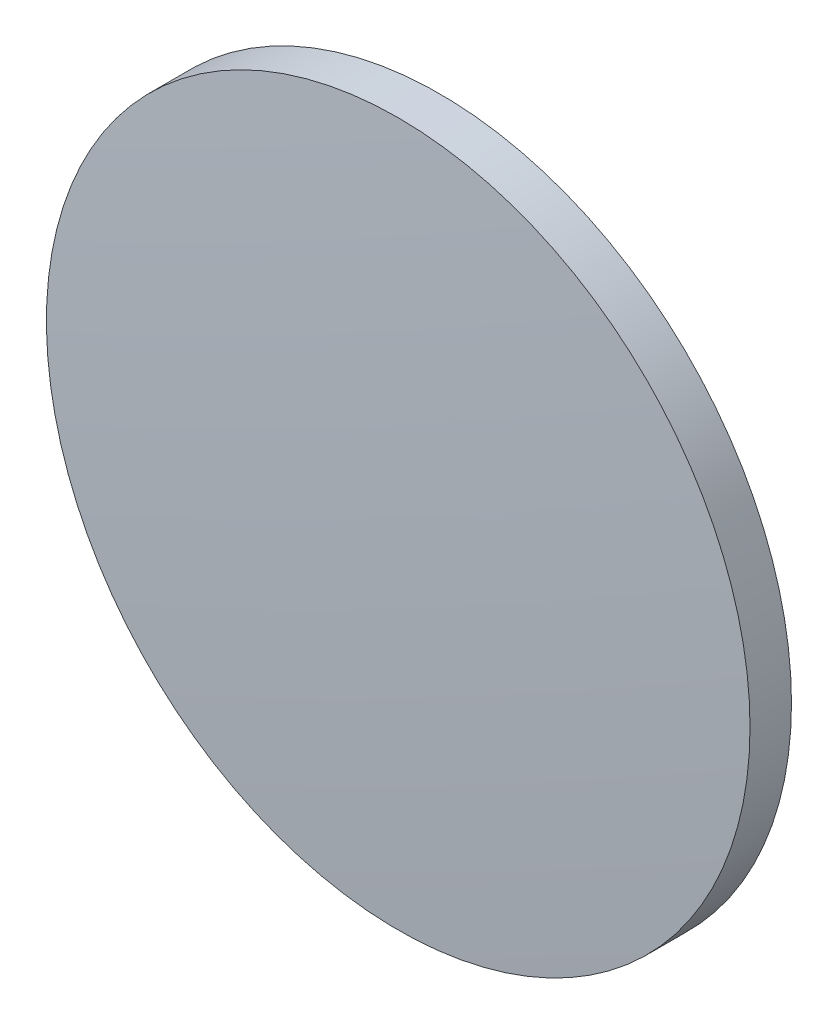
ISO-10303-21;
HEADER;
FILE_DESCRIPTION(('STEP AP214'),'2;1');
FILE_NAME('part.step','',(''),(''),'','','');
FILE_SCHEMA(('AUTOMOTIVE_DESIGN { 1 0 10303 214 1 1 1 1 }'));
ENDSEC;
DATA;
#1=APPLICATION_CONTEXT('core data for automotive mechanical design processes');
#2=APPLICATION_PROTOCOL_DEFINITION('international standard','automotive_design',2000,#1);
#3=PRODUCT_CONTEXT('',#1,'mechanical');
#4=PRODUCT('Part','Part','',(#3));
#5=PRODUCT_RELATED_PRODUCT_CATEGORY('part','',(#4));
#6=PRODUCT_DEFINITION_FORMATION('','',#4);
#7=PRODUCT_DEFINITION_CONTEXT('part definition',#1,'design');
#8=PRODUCT_DEFINITION('design','',#6,#7);
#9=PRODUCT_DEFINITION_SHAPE('','',#8);
#10=(LENGTH_UNIT() NAMED_UNIT(*) SI_UNIT(.MILLI.,.METRE.));
#11=(NAMED_UNIT(*) PLANE_ANGLE_UNIT() SI_UNIT($,.RADIAN.));
#12=(NAMED_UNIT(*) SI_UNIT($,.STERADIAN.) SOLID_ANGLE_UNIT());
#13=UNCERTAINTY_MEASURE_WITH_UNIT(LENGTH_MEASURE(1.E-05),#10,'distance_accuracy_value','');
#14=(GEOMETRIC_REPRESENTATION_CONTEXT(3) GLOBAL_UNCERTAINTY_ASSIGNED_CONTEXT((#13)) GLOBAL_UNIT_ASSIGNED_CONTEXT((#10,
#11,#12)) REPRESENTATION_CONTEXT('',''));
#15=CARTESIAN_POINT('',(0.,0.,0.));
#16=DIRECTION('',(0.,0.,1.));
#17=DIRECTION('',(1.,0.,0.));
#18=AXIS2_PLACEMENT_3D('',#15,#16,#17);
#19=CARTESIAN_POINT('',(0.,0.,-513.27));
#20=DIRECTION('',(0.,0.,1.));
#21=DIRECTION('',(0.,1.,0.));
#22=AXIS2_PLACEMENT_3D('',#19,#20,#21);
#23=SPHERICAL_SURFACE('',#22,515.08);
#24=CARTESIAN_POINT('',(0.,0.,1.18334715598845));
#25=DIRECTION('',(0.,0.,1.));
#26=DIRECTION('',(1.,0.,0.));
#27=AXIS2_PLACEMENT_3D('',#24,#25,#26);
#28=CIRCLE('',#27,25.4);
#29=CARTESIAN_POINT('',(25.4,0.,1.18334715598845));
#30=VERTEX_POINT('',#29);
#31=EDGE_CURVE('E8',#30,#30,#28,.T.);
#32=ORIENTED_EDGE('',*,*,#31,.T.);
#33=EDGE_LOOP('',(#32));
#34=FACE_BOUND('',#33,.T.);
#35=ADVANCED_FACE('F12',(#34),#23,.T.);
#36=CARTESIAN_POINT('',(0.,0.,4.30813204540037));
#37=DIRECTION('',(0.,0.,1.));
#38=DIRECTION('',(1.,0.,0.));
#39=AXIS2_PLACEMENT_3D('',#36,#37,#38);
#40=CYLINDRICAL_SURFACE('',#39,25.4);
#41=ORIENTED_EDGE('',*,*,#31,.F.);
#42=EDGE_LOOP('',(#41));
#43=FACE_BOUND('',#42,.T.);
#44=CARTESIAN_POINT('',(0.,0.,-1.81));
#45=DIRECTION('',(0.,0.,1.));
#46=DIRECTION('',(1.,0.,0.));
#47=AXIS2_PLACEMENT_3D('',#44,#45,#46);
#48=CIRCLE('',#47,25.4);
#49=CARTESIAN_POINT('',(25.4,0.,-1.81));
#50=VERTEX_POINT('',#49);
#51=EDGE_CURVE('E18',#50,#50,#48,.T.);
#52=ORIENTED_EDGE('',*,*,#51,.T.);
#53=EDGE_LOOP('',(#52));
#54=FACE_BOUND('',#53,.T.);
#55=ADVANCED_FACE('F24',(#43,#54),#40,.T.);
#56=CARTESIAN_POINT('',(0.,0.,-1.81));
#57=DIRECTION('',(0.,0.,1.));
#58=DIRECTION('',(1.,0.,0.));
#59=AXIS2_PLACEMENT_3D('',#56,#57,#58);
#60=PLANE('',#59);
#61=ORIENTED_EDGE('',*,*,#51,.F.);
#62=EDGE_LOOP('',(#61));
#63=FACE_BOUND('',#62,.T.);
#64=ADVANCED_FACE('F26',(#63),#60,.F.);
#65=CLOSED_SHELL('',(#35,#55,#64));
#66=MANIFOLD_SOLID_BREP('B1',#65);
#67=ADVANCED_BREP_SHAPE_REPRESENTATION('',(#18,#66),#14);
#68=SHAPE_DEFINITION_REPRESENTATION(#9,#67);
ENDSEC;
END-ISO-10303-21;
